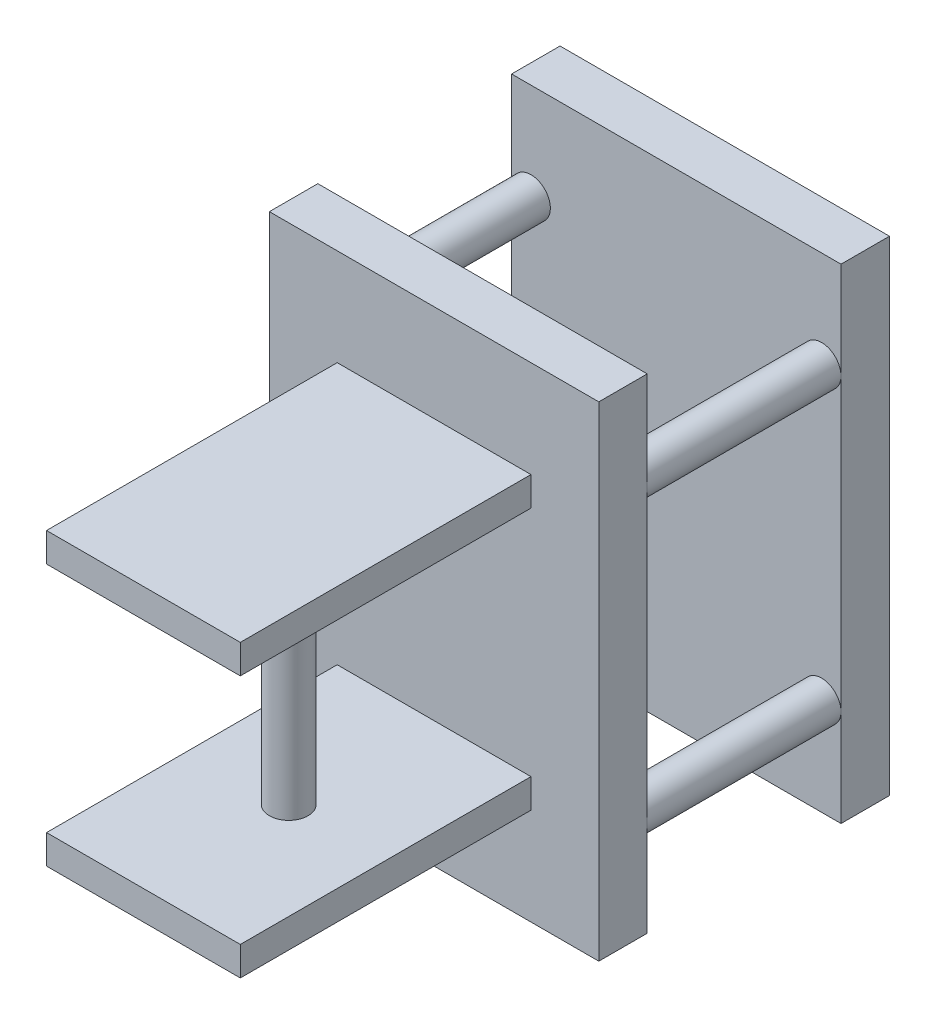
ISO-10303-21;
HEADER;
FILE_DESCRIPTION(('STEP AP214'),'2;1');
FILE_NAME('part.step','',(''),(''),'','','');
FILE_SCHEMA(('AUTOMOTIVE_DESIGN { 1 0 10303 214 1 1 1 1 }'));
ENDSEC;
DATA;
#1=APPLICATION_CONTEXT('core data for automotive mechanical design processes');
#2=APPLICATION_PROTOCOL_DEFINITION('international standard','automotive_design',2000,#1);
#3=PRODUCT_CONTEXT('',#1,'mechanical');
#4=PRODUCT('Part','Part','',(#3));
#5=PRODUCT_RELATED_PRODUCT_CATEGORY('part','',(#4));
#6=PRODUCT_DEFINITION_FORMATION('','',#4);
#7=PRODUCT_DEFINITION_CONTEXT('part definition',#1,'design');
#8=PRODUCT_DEFINITION('design','',#6,#7);
#9=PRODUCT_DEFINITION_SHAPE('','',#8);
#10=(LENGTH_UNIT() NAMED_UNIT(*) SI_UNIT(.MILLI.,.METRE.));
#11=(NAMED_UNIT(*) PLANE_ANGLE_UNIT() SI_UNIT($,.RADIAN.));
#12=(NAMED_UNIT(*) SI_UNIT($,.STERADIAN.) SOLID_ANGLE_UNIT());
#13=UNCERTAINTY_MEASURE_WITH_UNIT(LENGTH_MEASURE(1.E-05),#10,'distance_accuracy_value','');
#14=(GEOMETRIC_REPRESENTATION_CONTEXT(3) GLOBAL_UNCERTAINTY_ASSIGNED_CONTEXT((#13)) GLOBAL_UNIT_ASSIGNED_CONTEXT((#10,
#11,#12)) REPRESENTATION_CONTEXT('',''));
#15=CARTESIAN_POINT('',(0.,0.,0.));
#16=DIRECTION('',(0.,0.,1.));
#17=DIRECTION('',(1.,0.,0.));
#18=AXIS2_PLACEMENT_3D('',#15,#16,#17);
#19=CARTESIAN_POINT('',(0.,0.,30.));
#20=DIRECTION('',(0.,0.,1.));
#21=DIRECTION('',(1.,0.,0.));
#22=AXIS2_PLACEMENT_3D('',#19,#20,#21);
#23=PLANE('',#22);
#24=DIRECTION('',(0.,-1.,0.));
#25=VECTOR('',#24,1.);
#26=CARTESIAN_POINT('',(5.05072994103772,0.,30.));
#27=LINE('',#26,#25);
#28=CARTESIAN_POINT('',(5.05072994103772,5.19455564074899,30.));
#29=VERTEX_POINT('',#28);
#30=CARTESIAN_POINT('',(5.05072994103772,2.19455564074899,30.));
#31=VERTEX_POINT('',#30);
#32=EDGE_CURVE('E180',#29,#31,#27,.T.);
#33=ORIENTED_EDGE('',*,*,#32,.T.);
#34=DIRECTION('',(1.,0.,0.));
#35=VECTOR('',#34,1.);
#36=CARTESIAN_POINT('',(0.,2.19455564074899,30.));
#37=LINE('',#36,#35);
#38=CARTESIAN_POINT('',(-14.9492700589623,2.19455564074899,30.));
#39=VERTEX_POINT('',#38);
#40=EDGE_CURVE('E194',#39,#31,#37,.T.);
#41=ORIENTED_EDGE('',*,*,#40,.F.);
#42=DIRECTION('',(0.,-1.,0.));
#43=VECTOR('',#42,1.);
#44=CARTESIAN_POINT('',(-14.9492700589623,0.,30.));
#45=LINE('',#44,#43);
#46=CARTESIAN_POINT('',(-14.9492700589623,5.19455564074899,30.));
#47=VERTEX_POINT('',#46);
#48=EDGE_CURVE('E208',#47,#39,#45,.T.);
#49=ORIENTED_EDGE('',*,*,#48,.F.);
#50=DIRECTION('',(1.,0.,0.));
#51=VECTOR('',#50,1.);
#52=CARTESIAN_POINT('',(0.,5.19455564074899,30.));
#53=LINE('',#52,#51);
#54=EDGE_CURVE('E205',#47,#29,#53,.T.);
#55=ORIENTED_EDGE('',*,*,#54,.T.);
#56=EDGE_LOOP('',(#33,#41,#49,#55));
#57=FACE_BOUND('',#56,.T.);
#58=DIRECTION('',(0.,-1.,0.));
#59=VECTOR('',#58,1.);
#60=CARTESIAN_POINT('',(-21.9492700589623,42.194555640749,30.));
#61=LINE('',#60,#59);
#62=CARTESIAN_POINT('',(-21.9492700589623,42.194555640749,30.));
#63=VERTEX_POINT('',#62);
#64=CARTESIAN_POINT('',(-21.9492700589623,-7.80544435925101,30.));
#65=VERTEX_POINT('',#64);
#66=EDGE_CURVE('E244',#63,#65,#61,.T.);
#67=ORIENTED_EDGE('',*,*,#66,.T.);
#68=DIRECTION('',(1.,0.,0.));
#69=VECTOR('',#68,1.);
#70=CARTESIAN_POINT('',(-21.9492700589623,-7.80544435925101,30.));
#71=LINE('',#70,#69);
#72=CARTESIAN_POINT('',(12.0507299410377,-7.80544435925101,30.));
#73=VERTEX_POINT('',#72);
#74=EDGE_CURVE('E247',#65,#73,#71,.T.);
#75=ORIENTED_EDGE('',*,*,#74,.T.);
#76=DIRECTION('',(0.,1.,0.));
#77=VECTOR('',#76,1.);
#78=CARTESIAN_POINT('',(12.0507299410377,42.194555640749,30.));
#79=LINE('',#78,#77);
#80=CARTESIAN_POINT('',(12.0507299410377,42.194555640749,30.));
#81=VERTEX_POINT('',#80);
#82=EDGE_CURVE('E250',#73,#81,#79,.T.);
#83=ORIENTED_EDGE('',*,*,#82,.T.);
#84=DIRECTION('',(-1.,0.,0.));
#85=VECTOR('',#84,1.);
#86=CARTESIAN_POINT('',(-21.9492700589623,42.194555640749,30.));
#87=LINE('',#86,#85);
#88=EDGE_CURVE('E252',#81,#63,#87,.T.);
#89=ORIENTED_EDGE('',*,*,#88,.T.);
#90=EDGE_LOOP('',(#67,#75,#83,#89));
#91=FACE_BOUND('',#90,.T.);
#92=DIRECTION('',(0.,1.,0.));
#93=VECTOR('',#92,1.);
#94=CARTESIAN_POINT('',(5.05072994103772,0.,30.));
#95=LINE('',#94,#93);
#96=CARTESIAN_POINT('',(5.05072994103772,29.194555640749,30.));
#97=VERTEX_POINT('',#96);
#98=CARTESIAN_POINT('',(5.05072994103772,32.194555640749,30.));
#99=VERTEX_POINT('',#98);
#100=EDGE_CURVE('E59',#97,#99,#95,.T.);
#101=ORIENTED_EDGE('',*,*,#100,.F.);
#102=DIRECTION('',(1.,0.,0.));
#103=VECTOR('',#102,1.);
#104=CARTESIAN_POINT('',(0.,29.194555640749,30.));
#105=LINE('',#104,#103);
#106=CARTESIAN_POINT('',(-14.9492700589623,29.194555640749,30.));
#107=VERTEX_POINT('',#106);
#108=EDGE_CURVE('E185',#107,#97,#105,.T.);
#109=ORIENTED_EDGE('',*,*,#108,.F.);
#110=DIRECTION('',(0.,1.,0.));
#111=VECTOR('',#110,1.);
#112=CARTESIAN_POINT('',(-14.9492700589623,0.,30.));
#113=LINE('',#112,#111);
#114=CARTESIAN_POINT('',(-14.9492700589623,32.194555640749,30.));
#115=VERTEX_POINT('',#114);
#116=EDGE_CURVE('E218',#107,#115,#113,.T.);
#117=ORIENTED_EDGE('',*,*,#116,.T.);
#118=DIRECTION('',(1.,0.,0.));
#119=VECTOR('',#118,1.);
#120=CARTESIAN_POINT('',(0.,32.194555640749,30.));
#121=LINE('',#120,#119);
#122=EDGE_CURVE('E230',#115,#99,#121,.T.);
#123=ORIENTED_EDGE('',*,*,#122,.T.);
#124=EDGE_LOOP('',(#101,#109,#117,#123));
#125=FACE_BOUND('',#124,.T.);
#126=ADVANCED_FACE('F35',(#57,#91,#125),#23,.T.);
#127=CARTESIAN_POINT('',(-21.9492700589623,41.9996515332699,5.));
#128=DIRECTION('',(1.,0.,0.));
#129=DIRECTION('',(0.,0.,-1.));
#130=AXIS2_PLACEMENT_3D('',#127,#128,#129);
#131=PLANE('',#130);
#132=DIRECTION('',(0.,-1.,0.));
#133=VECTOR('',#132,1.);
#134=CARTESIAN_POINT('',(-21.9492700589623,41.9996515332699,0.));
#135=LINE('',#134,#133);
#136=CARTESIAN_POINT('',(-21.9492700589623,41.9996515332699,0.));
#137=VERTEX_POINT('',#136);
#138=CARTESIAN_POINT('',(-21.9492700589623,-8.00034846673014,0.));
#139=VERTEX_POINT('',#138);
#140=EDGE_CURVE('E299',#137,#139,#135,.T.);
#141=ORIENTED_EDGE('',*,*,#140,.T.);
#142=DIRECTION('',(0.,0.,-1.));
#143=VECTOR('',#142,1.);
#144=CARTESIAN_POINT('',(-21.9492700589623,-8.00034846673014,5.));
#145=LINE('',#144,#143);
#146=CARTESIAN_POINT('',(-21.9492700589623,-8.00034846673014,5.));
#147=VERTEX_POINT('',#146);
#148=EDGE_CURVE('E39',#147,#139,#145,.T.);
#149=ORIENTED_EDGE('',*,*,#148,.F.);
#150=DIRECTION('',(0.,-1.,0.));
#151=VECTOR('',#150,1.);
#152=CARTESIAN_POINT('',(-21.9492700589623,41.9996515332699,5.));
#153=LINE('',#152,#151);
#154=CARTESIAN_POINT('',(-21.9492700589623,1.99965153326986,5.));
#155=VERTEX_POINT('',#154);
#156=EDGE_CURVE('E306',#155,#147,#153,.T.);
#157=ORIENTED_EDGE('',*,*,#156,.F.);
#158=CARTESIAN_POINT('',(-21.9492700589623,31.9996515332699,5.));
#159=VERTEX_POINT('',#158);
#160=EDGE_CURVE('E305',#159,#155,#153,.T.);
#161=ORIENTED_EDGE('',*,*,#160,.F.);
#162=CARTESIAN_POINT('',(-21.9492700589623,41.9996515332699,5.));
#163=VERTEX_POINT('',#162);
#164=EDGE_CURVE('E302',#163,#159,#153,.T.);
#165=ORIENTED_EDGE('',*,*,#164,.F.);
#166=DIRECTION('',(0.,0.,-1.));
#167=VECTOR('',#166,1.);
#168=CARTESIAN_POINT('',(-21.9492700589623,41.9996515332699,5.));
#169=LINE('',#168,#167);
#170=EDGE_CURVE('E315',#163,#137,#169,.T.);
#171=ORIENTED_EDGE('',*,*,#170,.T.);
#172=EDGE_LOOP('',(#141,#149,#157,#161,#165,#171));
#173=FACE_BOUND('',#172,.T.);
#174=ADVANCED_FACE('F37',(#173),#131,.F.);
#175=CARTESIAN_POINT('',(-21.9492700589623,-8.00034846673014,5.));
#176=DIRECTION('',(0.,1.,0.));
#177=DIRECTION('',(0.,0.,1.));
#178=AXIS2_PLACEMENT_3D('',#175,#176,#177);
#179=PLANE('',#178);
#180=DIRECTION('',(1.,0.,0.));
#181=VECTOR('',#180,1.);
#182=CARTESIAN_POINT('',(-21.9492700589623,-8.00034846673014,0.));
#183=LINE('',#182,#181);
#184=CARTESIAN_POINT('',(12.0507299410377,-8.00034846673014,0.));
#185=VERTEX_POINT('',#184);
#186=EDGE_CURVE('E318',#139,#185,#183,.T.);
#187=ORIENTED_EDGE('',*,*,#186,.T.);
#188=DIRECTION('',(0.,0.,-1.));
#189=VECTOR('',#188,1.);
#190=CARTESIAN_POINT('',(12.0507299410377,-8.00034846673014,5.));
#191=LINE('',#190,#189);
#192=CARTESIAN_POINT('',(12.0507299410377,-8.00034846673014,5.));
#193=VERTEX_POINT('',#192);
#194=EDGE_CURVE('E328',#193,#185,#191,.T.);
#195=ORIENTED_EDGE('',*,*,#194,.F.);
#196=DIRECTION('',(1.,0.,0.));
#197=VECTOR('',#196,1.);
#198=CARTESIAN_POINT('',(-21.9492700589623,-8.00034846673014,5.));
#199=LINE('',#198,#197);
#200=EDGE_CURVE('E304',#147,#193,#199,.T.);
#201=ORIENTED_EDGE('',*,*,#200,.F.);
#202=ORIENTED_EDGE('',*,*,#148,.T.);
#203=EDGE_LOOP('',(#187,#195,#201,#202));
#204=FACE_BOUND('',#203,.T.);
#205=ADVANCED_FACE('F338',(#204),#179,.F.);
#206=CARTESIAN_POINT('',(12.0507299410377,41.9996515332699,5.));
#207=DIRECTION('',(-1.,0.,0.));
#208=DIRECTION('',(0.,-1.,0.));
#209=AXIS2_PLACEMENT_3D('',#206,#207,#208);
#210=PLANE('',#209);
#211=DIRECTION('',(0.,1.,0.));
#212=VECTOR('',#211,1.);
#213=CARTESIAN_POINT('',(12.0507299410377,41.9996515332699,0.));
#214=LINE('',#213,#212);
#215=CARTESIAN_POINT('',(12.0507299410377,41.9996515332699,0.));
#216=VERTEX_POINT('',#215);
#217=EDGE_CURVE('E320',#185,#216,#214,.T.);
#218=ORIENTED_EDGE('',*,*,#217,.T.);
#219=DIRECTION('',(0.,0.,-1.));
#220=VECTOR('',#219,1.);
#221=CARTESIAN_POINT('',(12.0507299410377,41.9996515332699,5.));
#222=LINE('',#221,#220);
#223=CARTESIAN_POINT('',(12.0507299410377,41.9996515332699,5.));
#224=VERTEX_POINT('',#223);
#225=EDGE_CURVE('E326',#224,#216,#222,.T.);
#226=ORIENTED_EDGE('',*,*,#225,.F.);
#227=DIRECTION('',(0.,1.,0.));
#228=VECTOR('',#227,1.);
#229=CARTESIAN_POINT('',(12.0507299410377,41.9996515332699,5.));
#230=LINE('',#229,#228);
#231=CARTESIAN_POINT('',(12.0507299410377,31.9996515332699,5.));
#232=VERTEX_POINT('',#231);
#233=EDGE_CURVE('E308',#232,#224,#230,.T.);
#234=ORIENTED_EDGE('',*,*,#233,.F.);
#235=CARTESIAN_POINT('',(12.0507299410377,1.99965153326986,5.));
#236=VERTEX_POINT('',#235);
#237=EDGE_CURVE('E313',#236,#232,#230,.T.);
#238=ORIENTED_EDGE('',*,*,#237,.F.);
#239=EDGE_CURVE('E309',#193,#236,#230,.T.);
#240=ORIENTED_EDGE('',*,*,#239,.F.);
#241=ORIENTED_EDGE('',*,*,#194,.T.);
#242=EDGE_LOOP('',(#218,#226,#234,#238,#240,#241));
#243=FACE_BOUND('',#242,.T.);
#244=ADVANCED_FACE('F348',(#243),#210,.F.);
#245=CARTESIAN_POINT('',(-21.9492700589623,41.9996515332699,5.));
#246=DIRECTION('',(0.,-1.,0.));
#247=DIRECTION('',(0.,0.,-1.));
#248=AXIS2_PLACEMENT_3D('',#245,#246,#247);
#249=PLANE('',#248);
#250=DIRECTION('',(-1.,0.,0.));
#251=VECTOR('',#250,1.);
#252=CARTESIAN_POINT('',(-21.9492700589623,41.9996515332699,0.));
#253=LINE('',#252,#251);
#254=EDGE_CURVE('E322',#216,#137,#253,.T.);
#255=ORIENTED_EDGE('',*,*,#254,.T.);
#256=ORIENTED_EDGE('',*,*,#170,.F.);
#257=DIRECTION('',(-1.,0.,0.));
#258=VECTOR('',#257,1.);
#259=CARTESIAN_POINT('',(-21.9492700589623,41.9996515332699,5.));
#260=LINE('',#259,#258);
#261=EDGE_CURVE('E312',#224,#163,#260,.T.);
#262=ORIENTED_EDGE('',*,*,#261,.F.);
#263=ORIENTED_EDGE('',*,*,#225,.T.);
#264=EDGE_LOOP('',(#255,#256,#262,#263));
#265=FACE_BOUND('',#264,.T.);
#266=ADVANCED_FACE('F352',(#265),#249,.F.);
#267=CARTESIAN_POINT('',(0.,0.,5.));
#268=DIRECTION('',(0.,0.,1.));
#269=DIRECTION('',(1.,0.,0.));
#270=AXIS2_PLACEMENT_3D('',#267,#268,#269);
#271=PLANE('',#270);
#272=ORIENTED_EDGE('',*,*,#239,.T.);
#273=CARTESIAN_POINT('',(10.0507299410377,1.99965153326986,5.));
#274=DIRECTION('',(0.,0.,1.));
#275=DIRECTION('',(1.,0.,0.));
#276=AXIS2_PLACEMENT_3D('',#273,#274,#275);
#277=CIRCLE('',#276,2.);
#278=EDGE_CURVE('E278',#236,#236,#277,.T.);
#279=ORIENTED_EDGE('',*,*,#278,.F.);
#280=ORIENTED_EDGE('',*,*,#237,.T.);
#281=CARTESIAN_POINT('',(10.0507299410377,31.9996515332699,5.));
#282=DIRECTION('',(0.,0.,1.));
#283=DIRECTION('',(1.,0.,0.));
#284=AXIS2_PLACEMENT_3D('',#281,#282,#283);
#285=CIRCLE('',#284,2.);
#286=EDGE_CURVE('E282',#232,#232,#285,.F.);
#287=ORIENTED_EDGE('',*,*,#286,.T.);
#288=ORIENTED_EDGE('',*,*,#233,.T.);
#289=ORIENTED_EDGE('',*,*,#261,.T.);
#290=ORIENTED_EDGE('',*,*,#164,.T.);
#291=CARTESIAN_POINT('',(-19.9492700589623,31.9996515332699,5.));
#292=DIRECTION('',(0.,0.,1.));
#293=DIRECTION('',(1.,0.,0.));
#294=AXIS2_PLACEMENT_3D('',#291,#292,#293);
#295=CIRCLE('',#294,2.);
#296=EDGE_CURVE('E293',#159,#159,#295,.T.);
#297=ORIENTED_EDGE('',*,*,#296,.F.);
#298=ORIENTED_EDGE('',*,*,#160,.T.);
#299=CARTESIAN_POINT('',(-19.9492700589623,1.99965153326986,5.));
#300=DIRECTION('',(0.,0.,1.));
#301=DIRECTION('',(1.,0.,0.));
#302=AXIS2_PLACEMENT_3D('',#299,#300,#301);
#303=CIRCLE('',#302,2.);
#304=EDGE_CURVE('E287',#155,#155,#303,.F.);
#305=ORIENTED_EDGE('',*,*,#304,.T.);
#306=ORIENTED_EDGE('',*,*,#156,.T.);
#307=ORIENTED_EDGE('',*,*,#200,.T.);
#308=EDGE_LOOP('',(#272,#279,#280,#287,#288,#289,#290,#297,#298,#305,#306,#307));
#309=FACE_BOUND('',#308,.T.);
#310=ADVANCED_FACE('F354',(#309),#271,.T.);
#311=CARTESIAN_POINT('',(0.,0.,0.));
#312=DIRECTION('',(0.,0.,1.));
#313=DIRECTION('',(1.,0.,0.));
#314=AXIS2_PLACEMENT_3D('',#311,#312,#313);
#315=PLANE('',#314);
#316=ORIENTED_EDGE('',*,*,#140,.F.);
#317=ORIENTED_EDGE('',*,*,#254,.F.);
#318=ORIENTED_EDGE('',*,*,#217,.F.);
#319=ORIENTED_EDGE('',*,*,#186,.F.);
#320=EDGE_LOOP('',(#316,#317,#318,#319));
#321=FACE_BOUND('',#320,.T.);
#322=ADVANCED_FACE('F346',(#321),#315,.F.);
#323=CARTESIAN_POINT('',(-19.9492700589623,31.9996515332699,25.));
#324=DIRECTION('',(0.,0.,-1.));
#325=DIRECTION('',(-1.,0.,0.));
#326=AXIS2_PLACEMENT_3D('',#323,#324,#325);
#327=CYLINDRICAL_SURFACE('',#326,2.);
#328=CARTESIAN_POINT('',(-19.9492700589623,31.9996515332699,25.));
#329=DIRECTION('',(0.,0.,1.));
#330=DIRECTION('',(1.,0.,0.));
#331=AXIS2_PLACEMENT_3D('',#328,#329,#330);
#332=CIRCLE('',#331,2.);
#333=CARTESIAN_POINT('',(-21.9492700589623,31.9996515332699,25.));
#334=VERTEX_POINT('',#333);
#335=EDGE_CURVE('E296',#334,#334,#332,.T.);
#336=ORIENTED_EDGE('',*,*,#335,.F.);
#337=EDGE_LOOP('',(#336));
#338=FACE_BOUND('',#337,.T.);
#339=ORIENTED_EDGE('',*,*,#296,.T.);
#340=EDGE_LOOP('',(#339));
#341=FACE_BOUND('',#340,.T.);
#342=ADVANCED_FACE('F362',(#338,#341),#327,.T.);
#343=CARTESIAN_POINT('',(-19.9492700589623,1.99965153326986,25.));
#344=DIRECTION('',(0.,0.,-1.));
#345=DIRECTION('',(-1.,0.,0.));
#346=AXIS2_PLACEMENT_3D('',#343,#344,#345);
#347=CYLINDRICAL_SURFACE('',#346,2.);
#348=CARTESIAN_POINT('',(-19.9492700589623,1.99965153326986,25.));
#349=DIRECTION('',(0.,0.,1.));
#350=DIRECTION('',(1.,0.,0.));
#351=AXIS2_PLACEMENT_3D('',#348,#349,#350);
#352=CIRCLE('',#351,2.);
#353=CARTESIAN_POINT('',(-21.9492700589623,1.99965153326986,25.));
#354=VERTEX_POINT('',#353);
#355=EDGE_CURVE('E290',#354,#354,#352,.F.);
#356=ORIENTED_EDGE('',*,*,#355,.T.);
#357=EDGE_LOOP('',(#356));
#358=FACE_BOUND('',#357,.T.);
#359=ORIENTED_EDGE('',*,*,#304,.F.);
#360=EDGE_LOOP('',(#359));
#361=FACE_BOUND('',#360,.T.);
#362=ADVANCED_FACE('F364',(#358,#361),#347,.T.);
#363=CARTESIAN_POINT('',(10.0507299410377,31.9996515332699,25.));
#364=DIRECTION('',(0.,0.,-1.));
#365=DIRECTION('',(-1.,0.,0.));
#366=AXIS2_PLACEMENT_3D('',#363,#364,#365);
#367=CYLINDRICAL_SURFACE('',#366,2.);
#368=CARTESIAN_POINT('',(10.0507299410377,31.9996515332699,25.));
#369=DIRECTION('',(0.,0.,1.));
#370=DIRECTION('',(1.,0.,0.));
#371=AXIS2_PLACEMENT_3D('',#368,#369,#370);
#372=CIRCLE('',#371,2.);
#373=CARTESIAN_POINT('',(12.0507299410377,31.9996515332699,25.));
#374=VERTEX_POINT('',#373);
#375=EDGE_CURVE('E284',#374,#374,#372,.F.);
#376=ORIENTED_EDGE('',*,*,#375,.T.);
#377=EDGE_LOOP('',(#376));
#378=FACE_BOUND('',#377,.T.);
#379=ORIENTED_EDGE('',*,*,#286,.F.);
#380=EDGE_LOOP('',(#379));
#381=FACE_BOUND('',#380,.T.);
#382=ADVANCED_FACE('F371',(#378,#381),#367,.T.);
#383=CARTESIAN_POINT('',(10.0507299410377,1.99965153326986,25.));
#384=DIRECTION('',(0.,0.,-1.));
#385=DIRECTION('',(-1.,0.,0.));
#386=AXIS2_PLACEMENT_3D('',#383,#384,#385);
#387=CYLINDRICAL_SURFACE('',#386,2.);
#388=CARTESIAN_POINT('',(10.0507299410377,1.99965153326986,25.));
#389=DIRECTION('',(0.,0.,1.));
#390=DIRECTION('',(1.,0.,0.));
#391=AXIS2_PLACEMENT_3D('',#388,#389,#390);
#392=CIRCLE('',#391,2.);
#393=CARTESIAN_POINT('',(12.0507299410377,1.99965153326986,25.));
#394=VERTEX_POINT('',#393);
#395=EDGE_CURVE('E279',#394,#394,#392,.T.);
#396=ORIENTED_EDGE('',*,*,#395,.F.);
#397=EDGE_LOOP('',(#396));
#398=FACE_BOUND('',#397,.T.);
#399=ORIENTED_EDGE('',*,*,#278,.T.);
#400=EDGE_LOOP('',(#399));
#401=FACE_BOUND('',#400,.T.);
#402=ADVANCED_FACE('F391',(#398,#401),#387,.T.);
#403=CARTESIAN_POINT('',(0.,0.,25.));
#404=DIRECTION('',(0.,0.,1.));
#405=DIRECTION('',(1.,0.,0.));
#406=AXIS2_PLACEMENT_3D('',#403,#404,#405);
#407=PLANE('',#406);
#408=DIRECTION('',(0.,-1.,0.));
#409=VECTOR('',#408,1.);
#410=CARTESIAN_POINT('',(-21.9492700589623,42.194555640749,25.));
#411=LINE('',#410,#409);
#412=EDGE_CURVE('E259',#334,#354,#411,.T.);
#413=ORIENTED_EDGE('',*,*,#412,.F.);
#414=ORIENTED_EDGE('',*,*,#335,.T.);
#415=CARTESIAN_POINT('',(-21.9492700589623,42.194555640749,25.));
#416=VERTEX_POINT('',#415);
#417=EDGE_CURVE('E255',#416,#334,#411,.T.);
#418=ORIENTED_EDGE('',*,*,#417,.F.);
#419=DIRECTION('',(-1.,0.,0.));
#420=VECTOR('',#419,1.);
#421=CARTESIAN_POINT('',(-21.9492700589623,42.194555640749,25.));
#422=LINE('',#421,#420);
#423=CARTESIAN_POINT('',(12.0507299410377,42.194555640749,25.));
#424=VERTEX_POINT('',#423);
#425=EDGE_CURVE('E248',#424,#416,#422,.T.);
#426=ORIENTED_EDGE('',*,*,#425,.F.);
#427=DIRECTION('',(0.,1.,0.));
#428=VECTOR('',#427,1.);
#429=CARTESIAN_POINT('',(12.0507299410377,42.194555640749,25.));
#430=LINE('',#429,#428);
#431=EDGE_CURVE('E261',#374,#424,#430,.T.);
#432=ORIENTED_EDGE('',*,*,#431,.F.);
#433=ORIENTED_EDGE('',*,*,#375,.F.);
#434=EDGE_CURVE('E265',#394,#374,#430,.T.);
#435=ORIENTED_EDGE('',*,*,#434,.F.);
#436=ORIENTED_EDGE('',*,*,#395,.T.);
#437=CARTESIAN_POINT('',(12.0507299410377,-7.80544435925101,25.));
#438=VERTEX_POINT('',#437);
#439=EDGE_CURVE('E262',#438,#394,#430,.T.);
#440=ORIENTED_EDGE('',*,*,#439,.F.);
#441=DIRECTION('',(1.,0.,0.));
#442=VECTOR('',#441,1.);
#443=CARTESIAN_POINT('',(-21.9492700589623,-7.80544435925101,25.));
#444=LINE('',#443,#442);
#445=CARTESIAN_POINT('',(-21.9492700589623,-7.80544435925101,25.));
#446=VERTEX_POINT('',#445);
#447=EDGE_CURVE('E258',#446,#438,#444,.T.);
#448=ORIENTED_EDGE('',*,*,#447,.F.);
#449=EDGE_CURVE('E243',#354,#446,#411,.T.);
#450=ORIENTED_EDGE('',*,*,#449,.F.);
#451=ORIENTED_EDGE('',*,*,#355,.F.);
#452=EDGE_LOOP('',(#413,#414,#418,#426,#432,#433,#435,#436,#440,#448,#450,#451));
#453=FACE_BOUND('',#452,.T.);
#454=ADVANCED_FACE('F387',(#453),#407,.F.);
#455=CARTESIAN_POINT('',(-21.9492700589623,42.194555640749,30.));
#456=DIRECTION('',(1.,0.,0.));
#457=DIRECTION('',(0.,1.,0.));
#458=AXIS2_PLACEMENT_3D('',#455,#456,#457);
#459=PLANE('',#458);
#460=ORIENTED_EDGE('',*,*,#417,.T.);
#461=ORIENTED_EDGE('',*,*,#412,.T.);
#462=ORIENTED_EDGE('',*,*,#449,.T.);
#463=DIRECTION('',(0.,0.,-1.));
#464=VECTOR('',#463,1.);
#465=CARTESIAN_POINT('',(-21.9492700589623,-7.80544435925101,30.));
#466=LINE('',#465,#464);
#467=EDGE_CURVE('E275',#65,#446,#466,.T.);
#468=ORIENTED_EDGE('',*,*,#467,.F.);
#469=ORIENTED_EDGE('',*,*,#66,.F.);
#470=DIRECTION('',(0.,0.,-1.));
#471=VECTOR('',#470,1.);
#472=CARTESIAN_POINT('',(-21.9492700589623,42.194555640749,30.));
#473=LINE('',#472,#471);
#474=EDGE_CURVE('E254',#63,#416,#473,.T.);
#475=ORIENTED_EDGE('',*,*,#474,.T.);
#476=EDGE_LOOP('',(#460,#461,#462,#468,#469,#475));
#477=FACE_BOUND('',#476,.T.);
#478=ADVANCED_FACE('F390',(#477),#459,.F.);
#479=CARTESIAN_POINT('',(-21.9492700589623,-7.80544435925101,30.));
#480=DIRECTION('',(0.,1.,0.));
#481=DIRECTION('',(0.,0.,1.));
#482=AXIS2_PLACEMENT_3D('',#479,#480,#481);
#483=PLANE('',#482);
#484=ORIENTED_EDGE('',*,*,#447,.T.);
#485=DIRECTION('',(0.,0.,-1.));
#486=VECTOR('',#485,1.);
#487=CARTESIAN_POINT('',(12.0507299410377,-7.80544435925101,30.));
#488=LINE('',#487,#486);
#489=EDGE_CURVE('E272',#73,#438,#488,.T.);
#490=ORIENTED_EDGE('',*,*,#489,.F.);
#491=ORIENTED_EDGE('',*,*,#74,.F.);
#492=ORIENTED_EDGE('',*,*,#467,.T.);
#493=EDGE_LOOP('',(#484,#490,#491,#492));
#494=FACE_BOUND('',#493,.T.);
#495=ADVANCED_FACE('F400',(#494),#483,.F.);
#496=CARTESIAN_POINT('',(12.0507299410377,42.194555640749,30.));
#497=DIRECTION('',(-1.,0.,0.));
#498=DIRECTION('',(0.,-1.,0.));
#499=AXIS2_PLACEMENT_3D('',#496,#497,#498);
#500=PLANE('',#499);
#501=ORIENTED_EDGE('',*,*,#439,.T.);
#502=ORIENTED_EDGE('',*,*,#434,.T.);
#503=ORIENTED_EDGE('',*,*,#431,.T.);
#504=DIRECTION('',(0.,0.,-1.));
#505=VECTOR('',#504,1.);
#506=CARTESIAN_POINT('',(12.0507299410377,42.194555640749,30.));
#507=LINE('',#506,#505);
#508=EDGE_CURVE('E269',#81,#424,#507,.T.);
#509=ORIENTED_EDGE('',*,*,#508,.F.);
#510=ORIENTED_EDGE('',*,*,#82,.F.);
#511=ORIENTED_EDGE('',*,*,#489,.T.);
#512=EDGE_LOOP('',(#501,#502,#503,#509,#510,#511));
#513=FACE_BOUND('',#512,.T.);
#514=ADVANCED_FACE('F396',(#513),#500,.F.);
#515=CARTESIAN_POINT('',(-21.9492700589623,42.194555640749,30.));
#516=DIRECTION('',(0.,-1.,0.));
#517=DIRECTION('',(0.,0.,-1.));
#518=AXIS2_PLACEMENT_3D('',#515,#516,#517);
#519=PLANE('',#518);
#520=ORIENTED_EDGE('',*,*,#425,.T.);
#521=ORIENTED_EDGE('',*,*,#474,.F.);
#522=ORIENTED_EDGE('',*,*,#88,.F.);
#523=ORIENTED_EDGE('',*,*,#508,.T.);
#524=EDGE_LOOP('',(#520,#521,#522,#523));
#525=FACE_BOUND('',#524,.T.);
#526=ADVANCED_FACE('F393',(#525),#519,.F.);
#527=CARTESIAN_POINT('',(0.,29.194555640749,60.));
#528=DIRECTION('',(0.,1.,0.));
#529=DIRECTION('',(0.,0.,1.));
#530=AXIS2_PLACEMENT_3D('',#527,#528,#529);
#531=PLANE('',#530);
#532=CARTESIAN_POINT('',(-4.94927005896228,29.194555640749,45.));
#533=DIRECTION('',(0.,1.,0.));
#534=DIRECTION('',(0.,0.,1.));
#535=AXIS2_PLACEMENT_3D('',#532,#533,#534);
#536=CIRCLE('',#535,2.);
#537=CARTESIAN_POINT('',(-4.94927005896228,29.194555640749,47.));
#538=VERTEX_POINT('',#537);
#539=EDGE_CURVE('E11',#538,#538,#536,.F.);
#540=ORIENTED_EDGE('',*,*,#539,.F.);
#541=EDGE_LOOP('',(#540));
#542=FACE_BOUND('',#541,.T.);
#543=ORIENTED_EDGE('',*,*,#108,.T.);
#544=DIRECTION('',(0.,0.,-1.));
#545=VECTOR('',#544,1.);
#546=CARTESIAN_POINT('',(5.05072994103772,29.194555640749,60.));
#547=LINE('',#546,#545);
#548=CARTESIAN_POINT('',(5.05072994103772,29.194555640749,60.));
#549=VERTEX_POINT('',#548);
#550=EDGE_CURVE('E241',#549,#97,#547,.T.);
#551=ORIENTED_EDGE('',*,*,#550,.F.);
#552=DIRECTION('',(1.,0.,0.));
#553=VECTOR('',#552,1.);
#554=CARTESIAN_POINT('',(0.,29.194555640749,60.));
#555=LINE('',#554,#553);
#556=CARTESIAN_POINT('',(-14.9492700589623,29.194555640749,60.));
#557=VERTEX_POINT('',#556);
#558=EDGE_CURVE('E214',#557,#549,#555,.T.);
#559=ORIENTED_EDGE('',*,*,#558,.F.);
#560=DIRECTION('',(0.,0.,-1.));
#561=VECTOR('',#560,1.);
#562=CARTESIAN_POINT('',(-14.9492700589623,29.194555640749,60.));
#563=LINE('',#562,#561);
#564=EDGE_CURVE('E226',#557,#107,#563,.T.);
#565=ORIENTED_EDGE('',*,*,#564,.T.);
#566=EDGE_LOOP('',(#543,#551,#559,#565));
#567=FACE_BOUND('',#566,.T.);
#568=ADVANCED_FACE('F385',(#542,#567),#531,.F.);
#569=CARTESIAN_POINT('',(5.05072994103772,0.,60.));
#570=DIRECTION('',(-1.,0.,0.));
#571=DIRECTION('',(0.,0.,1.));
#572=AXIS2_PLACEMENT_3D('',#569,#570,#571);
#573=PLANE('',#572);
#574=ORIENTED_EDGE('',*,*,#100,.T.);
#575=DIRECTION('',(0.,0.,-1.));
#576=VECTOR('',#575,1.);
#577=CARTESIAN_POINT('',(5.05072994103772,32.194555640749,60.));
#578=LINE('',#577,#576);
#579=CARTESIAN_POINT('',(5.05072994103772,32.194555640749,60.));
#580=VERTEX_POINT('',#579);
#581=EDGE_CURVE('E238',#580,#99,#578,.T.);
#582=ORIENTED_EDGE('',*,*,#581,.F.);
#583=DIRECTION('',(0.,1.,0.));
#584=VECTOR('',#583,1.);
#585=CARTESIAN_POINT('',(5.05072994103772,0.,60.));
#586=LINE('',#585,#584);
#587=EDGE_CURVE('E217',#549,#580,#586,.T.);
#588=ORIENTED_EDGE('',*,*,#587,.F.);
#589=ORIENTED_EDGE('',*,*,#550,.T.);
#590=EDGE_LOOP('',(#574,#582,#588,#589));
#591=FACE_BOUND('',#590,.T.);
#592=ADVANCED_FACE('F467',(#591),#573,.F.);
#593=CARTESIAN_POINT('',(0.,32.194555640749,60.));
#594=DIRECTION('',(0.,1.,0.));
#595=DIRECTION('',(0.,0.,1.));
#596=AXIS2_PLACEMENT_3D('',#593,#594,#595);
#597=PLANE('',#596);
#598=ORIENTED_EDGE('',*,*,#122,.F.);
#599=DIRECTION('',(0.,0.,-1.));
#600=VECTOR('',#599,1.);
#601=CARTESIAN_POINT('',(-14.9492700589623,32.194555640749,60.));
#602=LINE('',#601,#600);
#603=CARTESIAN_POINT('',(-14.9492700589623,32.194555640749,60.));
#604=VERTEX_POINT('',#603);
#605=EDGE_CURVE('E235',#604,#115,#602,.T.);
#606=ORIENTED_EDGE('',*,*,#605,.F.);
#607=DIRECTION('',(1.,0.,0.));
#608=VECTOR('',#607,1.);
#609=CARTESIAN_POINT('',(0.,32.194555640749,60.));
#610=LINE('',#609,#608);
#611=EDGE_CURVE('E220',#604,#580,#610,.T.);
#612=ORIENTED_EDGE('',*,*,#611,.T.);
#613=ORIENTED_EDGE('',*,*,#581,.T.);
#614=EDGE_LOOP('',(#598,#606,#612,#613));
#615=FACE_BOUND('',#614,.T.);
#616=ADVANCED_FACE('F476',(#615),#597,.T.);
#617=CARTESIAN_POINT('',(-14.9492700589623,0.,60.));
#618=DIRECTION('',(-1.,0.,0.));
#619=DIRECTION('',(0.,0.,1.));
#620=AXIS2_PLACEMENT_3D('',#617,#618,#619);
#621=PLANE('',#620);
#622=ORIENTED_EDGE('',*,*,#116,.F.);
#623=ORIENTED_EDGE('',*,*,#564,.F.);
#624=DIRECTION('',(0.,1.,0.));
#625=VECTOR('',#624,1.);
#626=CARTESIAN_POINT('',(-14.9492700589623,0.,60.));
#627=LINE('',#626,#625);
#628=EDGE_CURVE('E223',#557,#604,#627,.T.);
#629=ORIENTED_EDGE('',*,*,#628,.T.);
#630=ORIENTED_EDGE('',*,*,#605,.T.);
#631=EDGE_LOOP('',(#622,#623,#629,#630));
#632=FACE_BOUND('',#631,.T.);
#633=ADVANCED_FACE('F483',(#632),#621,.T.);
#634=CARTESIAN_POINT('',(0.,0.,60.));
#635=DIRECTION('',(0.,0.,1.));
#636=DIRECTION('',(1.,0.,0.));
#637=AXIS2_PLACEMENT_3D('',#634,#635,#636);
#638=PLANE('',#637);
#639=ORIENTED_EDGE('',*,*,#558,.T.);
#640=ORIENTED_EDGE('',*,*,#587,.T.);
#641=ORIENTED_EDGE('',*,*,#611,.F.);
#642=ORIENTED_EDGE('',*,*,#628,.F.);
#643=EDGE_LOOP('',(#639,#640,#641,#642));
#644=FACE_BOUND('',#643,.T.);
#645=ADVANCED_FACE('F491',(#644),#638,.T.);
#646=CARTESIAN_POINT('',(5.05072994103772,0.,60.));
#647=DIRECTION('',(1.,0.,0.));
#648=DIRECTION('',(0.,0.,-1.));
#649=AXIS2_PLACEMENT_3D('',#646,#647,#648);
#650=PLANE('',#649);
#651=ORIENTED_EDGE('',*,*,#32,.F.);
#652=DIRECTION('',(0.,0.,-1.));
#653=VECTOR('',#652,1.);
#654=CARTESIAN_POINT('',(5.05072994103772,5.19455564074899,60.));
#655=LINE('',#654,#653);
#656=CARTESIAN_POINT('',(5.05072994103772,5.19455564074899,60.));
#657=VERTEX_POINT('',#656);
#658=EDGE_CURVE('E175',#657,#29,#655,.T.);
#659=ORIENTED_EDGE('',*,*,#658,.F.);
#660=DIRECTION('',(0.,-1.,0.));
#661=VECTOR('',#660,1.);
#662=CARTESIAN_POINT('',(5.05072994103772,0.,60.));
#663=LINE('',#662,#661);
#664=CARTESIAN_POINT('',(5.05072994103772,2.19455564074899,60.));
#665=VERTEX_POINT('',#664);
#666=EDGE_CURVE('E178',#657,#665,#663,.T.);
#667=ORIENTED_EDGE('',*,*,#666,.T.);
#668=DIRECTION('',(0.,0.,-1.));
#669=VECTOR('',#668,1.);
#670=CARTESIAN_POINT('',(5.05072994103772,2.19455564074899,60.));
#671=LINE('',#670,#669);
#672=EDGE_CURVE('E203',#665,#31,#671,.T.);
#673=ORIENTED_EDGE('',*,*,#672,.T.);
#674=EDGE_LOOP('',(#651,#659,#667,#673));
#675=FACE_BOUND('',#674,.T.);
#676=ADVANCED_FACE('F177',(#675),#650,.T.);
#677=CARTESIAN_POINT('',(0.,5.19455564074899,60.));
#678=DIRECTION('',(0.,1.,0.));
#679=DIRECTION('',(0.,0.,1.));
#680=AXIS2_PLACEMENT_3D('',#677,#678,#679);
#681=PLANE('',#680);
#682=CARTESIAN_POINT('',(-4.94927005896228,5.19455564074899,45.));
#683=DIRECTION('',(0.,1.,0.));
#684=DIRECTION('',(0.,0.,1.));
#685=AXIS2_PLACEMENT_3D('',#682,#683,#684);
#686=CIRCLE('',#685,2.);
#687=CARTESIAN_POINT('',(-4.94927005896228,5.19455564074899,47.));
#688=VERTEX_POINT('',#687);
#689=EDGE_CURVE('E206',#688,#688,#686,.T.);
#690=ORIENTED_EDGE('',*,*,#689,.F.);
#691=EDGE_LOOP('',(#690));
#692=FACE_BOUND('',#691,.T.);
#693=ORIENTED_EDGE('',*,*,#54,.F.);
#694=DIRECTION('',(0.,0.,-1.));
#695=VECTOR('',#694,1.);
#696=CARTESIAN_POINT('',(-14.9492700589623,5.19455564074899,60.));
#697=LINE('',#696,#695);
#698=CARTESIAN_POINT('',(-14.9492700589623,5.19455564074899,60.));
#699=VERTEX_POINT('',#698);
#700=EDGE_CURVE('E186',#699,#47,#697,.T.);
#701=ORIENTED_EDGE('',*,*,#700,.F.);
#702=DIRECTION('',(1.,0.,0.));
#703=VECTOR('',#702,1.);
#704=CARTESIAN_POINT('',(0.,5.19455564074899,60.));
#705=LINE('',#704,#703);
#706=EDGE_CURVE('E191',#699,#657,#705,.T.);
#707=ORIENTED_EDGE('',*,*,#706,.T.);
#708=ORIENTED_EDGE('',*,*,#658,.T.);
#709=EDGE_LOOP('',(#693,#701,#707,#708));
#710=FACE_BOUND('',#709,.T.);
#711=ADVANCED_FACE('F196',(#692,#710),#681,.T.);
#712=CARTESIAN_POINT('',(-14.9492700589623,0.,60.));
#713=DIRECTION('',(1.,0.,0.));
#714=DIRECTION('',(0.,0.,-1.));
#715=AXIS2_PLACEMENT_3D('',#712,#713,#714);
#716=PLANE('',#715);
#717=ORIENTED_EDGE('',*,*,#48,.T.);
#718=DIRECTION('',(0.,0.,-1.));
#719=VECTOR('',#718,1.);
#720=CARTESIAN_POINT('',(-14.9492700589623,2.19455564074899,60.));
#721=LINE('',#720,#719);
#722=CARTESIAN_POINT('',(-14.9492700589623,2.19455564074899,60.));
#723=VERTEX_POINT('',#722);
#724=EDGE_CURVE('E51',#723,#39,#721,.T.);
#725=ORIENTED_EDGE('',*,*,#724,.F.);
#726=DIRECTION('',(0.,-1.,0.));
#727=VECTOR('',#726,1.);
#728=CARTESIAN_POINT('',(-14.9492700589623,0.,60.));
#729=LINE('',#728,#727);
#730=EDGE_CURVE('E198',#699,#723,#729,.T.);
#731=ORIENTED_EDGE('',*,*,#730,.F.);
#732=ORIENTED_EDGE('',*,*,#700,.T.);
#733=EDGE_LOOP('',(#717,#725,#731,#732));
#734=FACE_BOUND('',#733,.T.);
#735=ADVANCED_FACE('F512',(#734),#716,.F.);
#736=CARTESIAN_POINT('',(0.,2.19455564074899,60.));
#737=DIRECTION('',(0.,1.,0.));
#738=DIRECTION('',(0.,0.,1.));
#739=AXIS2_PLACEMENT_3D('',#736,#737,#738);
#740=PLANE('',#739);
#741=ORIENTED_EDGE('',*,*,#40,.T.);
#742=ORIENTED_EDGE('',*,*,#672,.F.);
#743=DIRECTION('',(1.,0.,0.));
#744=VECTOR('',#743,1.);
#745=CARTESIAN_POINT('',(0.,2.19455564074899,60.));
#746=LINE('',#745,#744);
#747=EDGE_CURVE('E192',#723,#665,#746,.T.);
#748=ORIENTED_EDGE('',*,*,#747,.F.);
#749=ORIENTED_EDGE('',*,*,#724,.T.);
#750=EDGE_LOOP('',(#741,#742,#748,#749));
#751=FACE_BOUND('',#750,.T.);
#752=ADVANCED_FACE('F520',(#751),#740,.F.);
#753=CARTESIAN_POINT('',(0.,0.,60.));
#754=DIRECTION('',(0.,0.,1.));
#755=DIRECTION('',(1.,0.,0.));
#756=AXIS2_PLACEMENT_3D('',#753,#754,#755);
#757=PLANE('',#756);
#758=ORIENTED_EDGE('',*,*,#666,.F.);
#759=ORIENTED_EDGE('',*,*,#706,.F.);
#760=ORIENTED_EDGE('',*,*,#730,.T.);
#761=ORIENTED_EDGE('',*,*,#747,.T.);
#762=EDGE_LOOP('',(#758,#759,#760,#761));
#763=FACE_BOUND('',#762,.T.);
#764=ADVANCED_FACE('F190',(#763),#757,.T.);
#765=CARTESIAN_POINT('',(-4.94927005896228,30.194555640749,45.));
#766=DIRECTION('',(0.,-1.,0.));
#767=DIRECTION('',(0.,0.,-1.));
#768=AXIS2_PLACEMENT_3D('',#765,#766,#767);
#769=CYLINDRICAL_SURFACE('',#768,2.);
#770=ORIENTED_EDGE('',*,*,#689,.T.);
#771=EDGE_LOOP('',(#770));
#772=FACE_BOUND('',#771,.T.);
#773=ORIENTED_EDGE('',*,*,#539,.T.);
#774=EDGE_LOOP('',(#773));
#775=FACE_BOUND('',#774,.T.);
#776=ADVANCED_FACE('F533',(#772,#775),#769,.T.);
#777=CLOSED_SHELL('',(#126,#174,#205,#244,#266,#310,#322,#342,#362,#382,#402,#454,#478,#495,
#514,#526,#568,#592,#616,#633,#645,#676,#711,#735,#752,#764,#776));
#778=MANIFOLD_SOLID_BREP('B2',#777);
#779=ADVANCED_BREP_SHAPE_REPRESENTATION('',(#18,#778),#14);
#780=SHAPE_DEFINITION_REPRESENTATION(#9,#779);
ENDSEC;
END-ISO-10303-21;
